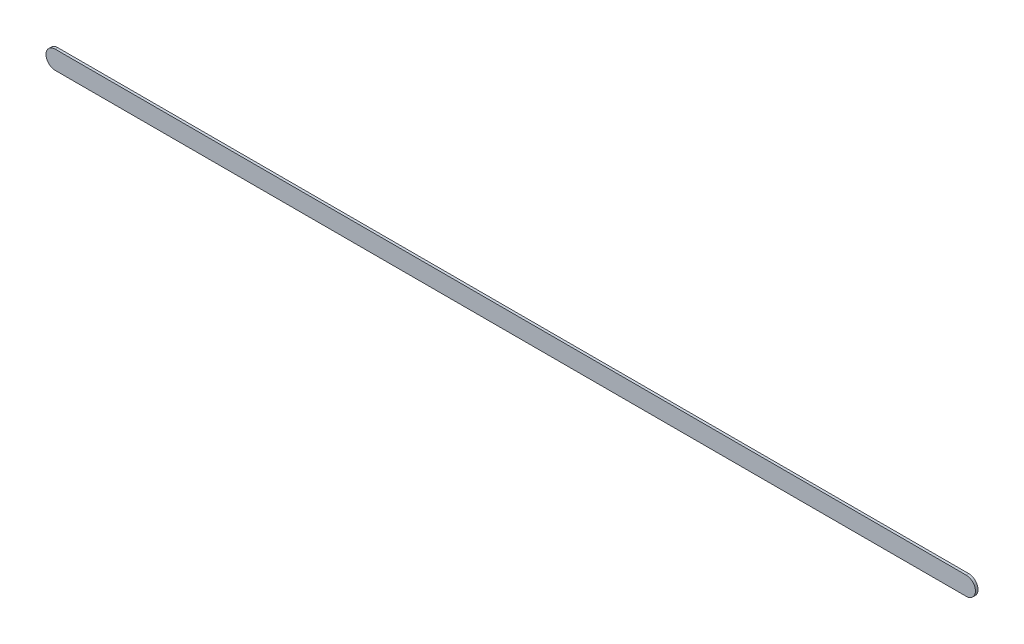
ISO-10303-21;
HEADER;
FILE_DESCRIPTION(('STEP AP214'),'2;1');
FILE_NAME('part.step','',(''),(''),'','','');
FILE_SCHEMA(('AUTOMOTIVE_DESIGN { 1 0 10303 214 1 1 1 1 }'));
ENDSEC;
DATA;
#1=APPLICATION_CONTEXT('core data for automotive mechanical design processes');
#2=APPLICATION_PROTOCOL_DEFINITION('international standard','automotive_design',2000,#1);
#3=PRODUCT_CONTEXT('',#1,'mechanical');
#4=PRODUCT('Part','Part','',(#3));
#5=PRODUCT_RELATED_PRODUCT_CATEGORY('part','',(#4));
#6=PRODUCT_DEFINITION_FORMATION('','',#4);
#7=PRODUCT_DEFINITION_CONTEXT('part definition',#1,'design');
#8=PRODUCT_DEFINITION('design','',#6,#7);
#9=PRODUCT_DEFINITION_SHAPE('','',#8);
#10=(LENGTH_UNIT() NAMED_UNIT(*) SI_UNIT(.MILLI.,.METRE.));
#11=(NAMED_UNIT(*) PLANE_ANGLE_UNIT() SI_UNIT($,.RADIAN.));
#12=(NAMED_UNIT(*) SI_UNIT($,.STERADIAN.) SOLID_ANGLE_UNIT());
#13=UNCERTAINTY_MEASURE_WITH_UNIT(LENGTH_MEASURE(1.E-05),#10,'distance_accuracy_value','');
#14=(GEOMETRIC_REPRESENTATION_CONTEXT(3) GLOBAL_UNCERTAINTY_ASSIGNED_CONTEXT((#13)) GLOBAL_UNIT_ASSIGNED_CONTEXT((#10,
#11,#12)) REPRESENTATION_CONTEXT('',''));
#15=CARTESIAN_POINT('',(0.,0.,0.));
#16=DIRECTION('',(0.,0.,1.));
#17=DIRECTION('',(1.,0.,0.));
#18=AXIS2_PLACEMENT_3D('',#15,#16,#17);
#19=CARTESIAN_POINT('',(82.11697318,50.35997294,0.));
#20=DIRECTION('',(0.,1.,0.));
#21=DIRECTION('',(1.,0.,0.));
#22=AXIS2_PLACEMENT_3D('',#19,#20,#21);
#23=PLANE('',#22);
#24=DIRECTION('',(1.,0.,0.));
#25=VECTOR('',#24,1.);
#26=CARTESIAN_POINT('',(82.11697318,50.35997294,0.03556));
#27=LINE('',#26,#25);
#28=CARTESIAN_POINT('',(82.11697318,50.35997294,0.03556));
#29=VERTEX_POINT('',#28);
#30=CARTESIAN_POINT('',(94.68268084,50.35997294,0.03556));
#31=VERTEX_POINT('',#30);
#32=EDGE_CURVE('E11',#29,#31,#27,.T.);
#33=ORIENTED_EDGE('',*,*,#32,.F.);
#34=DIRECTION('',(0.,0.,1.));
#35=VECTOR('',#34,1.);
#36=CARTESIAN_POINT('',(82.11697318,50.35997294,0.));
#37=LINE('',#36,#35);
#38=CARTESIAN_POINT('',(82.11697318,50.35997294,0.));
#39=VERTEX_POINT('',#38);
#40=EDGE_CURVE('E24',#39,#29,#37,.T.);
#41=ORIENTED_EDGE('',*,*,#40,.F.);
#42=DIRECTION('',(1.,0.,0.));
#43=VECTOR('',#42,1.);
#44=CARTESIAN_POINT('',(82.11697318,50.35997294,0.));
#45=LINE('',#44,#43);
#46=CARTESIAN_POINT('',(94.68268084,50.35997294,0.));
#47=VERTEX_POINT('',#46);
#48=EDGE_CURVE('E75',#39,#47,#45,.T.);
#49=ORIENTED_EDGE('',*,*,#48,.T.);
#50=DIRECTION('',(0.,0.,1.));
#51=VECTOR('',#50,1.);
#52=CARTESIAN_POINT('',(94.68268084,50.35997294,0.));
#53=LINE('',#52,#51);
#54=EDGE_CURVE('E37',#47,#31,#53,.T.);
#55=ORIENTED_EDGE('',*,*,#54,.T.);
#56=EDGE_LOOP('',(#33,#41,#49,#55));
#57=FACE_BOUND('',#56,.T.);
#58=ADVANCED_FACE('F17',(#57),#23,.F.);
#59=CARTESIAN_POINT('',(94.68268084,50.48697294,0.));
#60=DIRECTION('',(0.,0.,-1.));
#61=DIRECTION('',(1.11896493820486E-13,-1.,0.));
#62=AXIS2_PLACEMENT_3D('',#59,#60,#61);
#63=CYLINDRICAL_SURFACE('',#62,0.127000000000002);
#64=CARTESIAN_POINT('',(94.68268084,50.48697294,0.03556));
#65=DIRECTION('',(0.,0.,1.));
#66=DIRECTION('',(1.11896493820486E-13,-1.,0.));
#67=AXIS2_PLACEMENT_3D('',#64,#65,#66);
#68=CIRCLE('',#67,0.127000000000002);
#69=CARTESIAN_POINT('',(94.68268084,50.61397294,0.03556));
#70=VERTEX_POINT('',#69);
#71=EDGE_CURVE('E83',#31,#70,#68,.T.);
#72=ORIENTED_EDGE('',*,*,#71,.F.);
#73=ORIENTED_EDGE('',*,*,#54,.F.);
#74=CARTESIAN_POINT('',(94.68268084,50.48697294,0.));
#75=DIRECTION('',(0.,0.,1.));
#76=DIRECTION('',(1.11896493820486E-13,-1.,0.));
#77=AXIS2_PLACEMENT_3D('',#74,#75,#76);
#78=CIRCLE('',#77,0.127000000000002);
#79=CARTESIAN_POINT('',(94.68268084,50.61397294,0.));
#80=VERTEX_POINT('',#79);
#81=EDGE_CURVE('E81',#47,#80,#78,.T.);
#82=ORIENTED_EDGE('',*,*,#81,.T.);
#83=DIRECTION('',(0.,0.,1.));
#84=VECTOR('',#83,1.);
#85=CARTESIAN_POINT('',(94.68268084,50.61397294,0.));
#86=LINE('',#85,#84);
#87=EDGE_CURVE('E67',#80,#70,#86,.T.);
#88=ORIENTED_EDGE('',*,*,#87,.T.);
#89=EDGE_LOOP('',(#72,#73,#82,#88));
#90=FACE_BOUND('',#89,.T.);
#91=ADVANCED_FACE('F89',(#90),#63,.T.);
#92=CARTESIAN_POINT('',(94.68268084,50.61397294,0.));
#93=DIRECTION('',(0.,-1.,0.));
#94=DIRECTION('',(-1.,0.,0.));
#95=AXIS2_PLACEMENT_3D('',#92,#93,#94);
#96=PLANE('',#95);
#97=DIRECTION('',(-1.,0.,0.));
#98=VECTOR('',#97,1.);
#99=CARTESIAN_POINT('',(94.68268084,50.61397294,0.03556));
#100=LINE('',#99,#98);
#101=CARTESIAN_POINT('',(82.11697318,50.61397294,0.03556));
#102=VERTEX_POINT('',#101);
#103=EDGE_CURVE('E71',#70,#102,#100,.T.);
#104=ORIENTED_EDGE('',*,*,#103,.F.);
#105=ORIENTED_EDGE('',*,*,#87,.F.);
#106=DIRECTION('',(-1.,0.,0.));
#107=VECTOR('',#106,1.);
#108=CARTESIAN_POINT('',(94.68268084,50.61397294,0.));
#109=LINE('',#108,#107);
#110=CARTESIAN_POINT('',(82.11697318,50.61397294,0.));
#111=VERTEX_POINT('',#110);
#112=EDGE_CURVE('E63',#80,#111,#109,.T.);
#113=ORIENTED_EDGE('',*,*,#112,.T.);
#114=DIRECTION('',(0.,0.,1.));
#115=VECTOR('',#114,1.);
#116=CARTESIAN_POINT('',(82.11697318,50.61397294,0.));
#117=LINE('',#116,#115);
#118=EDGE_CURVE('E53',#111,#102,#117,.T.);
#119=ORIENTED_EDGE('',*,*,#118,.T.);
#120=EDGE_LOOP('',(#104,#105,#113,#119));
#121=FACE_BOUND('',#120,.T.);
#122=ADVANCED_FACE('F66',(#121),#96,.F.);
#123=CARTESIAN_POINT('',(82.11697318,50.48697294,0.));
#124=DIRECTION('',(0.,0.,-1.));
#125=DIRECTION('',(-1.11896493820486E-13,1.,0.));
#126=AXIS2_PLACEMENT_3D('',#123,#124,#125);
#127=CYLINDRICAL_SURFACE('',#126,0.127000000000002);
#128=CARTESIAN_POINT('',(82.11697318,50.48697294,0.03556));
#129=DIRECTION('',(0.,0.,1.));
#130=DIRECTION('',(-1.11896493820486E-13,1.,0.));
#131=AXIS2_PLACEMENT_3D('',#128,#129,#130);
#132=CIRCLE('',#131,0.127000000000002);
#133=EDGE_CURVE('E59',#102,#29,#132,.T.);
#134=ORIENTED_EDGE('',*,*,#133,.F.);
#135=ORIENTED_EDGE('',*,*,#118,.F.);
#136=CARTESIAN_POINT('',(82.11697318,50.48697294,0.));
#137=DIRECTION('',(0.,0.,1.));
#138=DIRECTION('',(-1.11896493820486E-13,1.,0.));
#139=AXIS2_PLACEMENT_3D('',#136,#137,#138);
#140=CIRCLE('',#139,0.127000000000002);
#141=EDGE_CURVE('E57',#111,#39,#140,.T.);
#142=ORIENTED_EDGE('',*,*,#141,.T.);
#143=ORIENTED_EDGE('',*,*,#40,.T.);
#144=EDGE_LOOP('',(#134,#135,#142,#143));
#145=FACE_BOUND('',#144,.T.);
#146=ADVANCED_FACE('F55',(#145),#127,.T.);
#147=CARTESIAN_POINT('',(82.11697318,50.35997294,0.));
#148=DIRECTION('',(0.,0.,-1.));
#149=DIRECTION('',(-1.,0.,0.));
#150=AXIS2_PLACEMENT_3D('',#147,#148,#149);
#151=PLANE('',#150);
#152=ORIENTED_EDGE('',*,*,#141,.F.);
#153=ORIENTED_EDGE('',*,*,#112,.F.);
#154=ORIENTED_EDGE('',*,*,#81,.F.);
#155=ORIENTED_EDGE('',*,*,#48,.F.);
#156=EDGE_LOOP('',(#152,#153,#154,#155));
#157=FACE_BOUND('',#156,.T.);
#158=ADVANCED_FACE('F74',(#157),#151,.T.);
#159=CARTESIAN_POINT('',(82.11697318,50.35997294,0.03556));
#160=DIRECTION('',(0.,0.,-1.));
#161=DIRECTION('',(-1.,0.,0.));
#162=AXIS2_PLACEMENT_3D('',#159,#160,#161);
#163=PLANE('',#162);
#164=ORIENTED_EDGE('',*,*,#32,.T.);
#165=ORIENTED_EDGE('',*,*,#71,.T.);
#166=ORIENTED_EDGE('',*,*,#103,.T.);
#167=ORIENTED_EDGE('',*,*,#133,.T.);
#168=EDGE_LOOP('',(#164,#165,#166,#167));
#169=FACE_BOUND('',#168,.T.);
#170=ADVANCED_FACE('F91',(#169),#163,.F.);
#171=CLOSED_SHELL('',(#58,#91,#122,#146,#158,#170));
#172=MANIFOLD_SOLID_BREP('B1',#171);
#173=ADVANCED_BREP_SHAPE_REPRESENTATION('',(#18,#172),#14);
#174=SHAPE_DEFINITION_REPRESENTATION(#9,#173);
ENDSEC;
END-ISO-10303-21;
